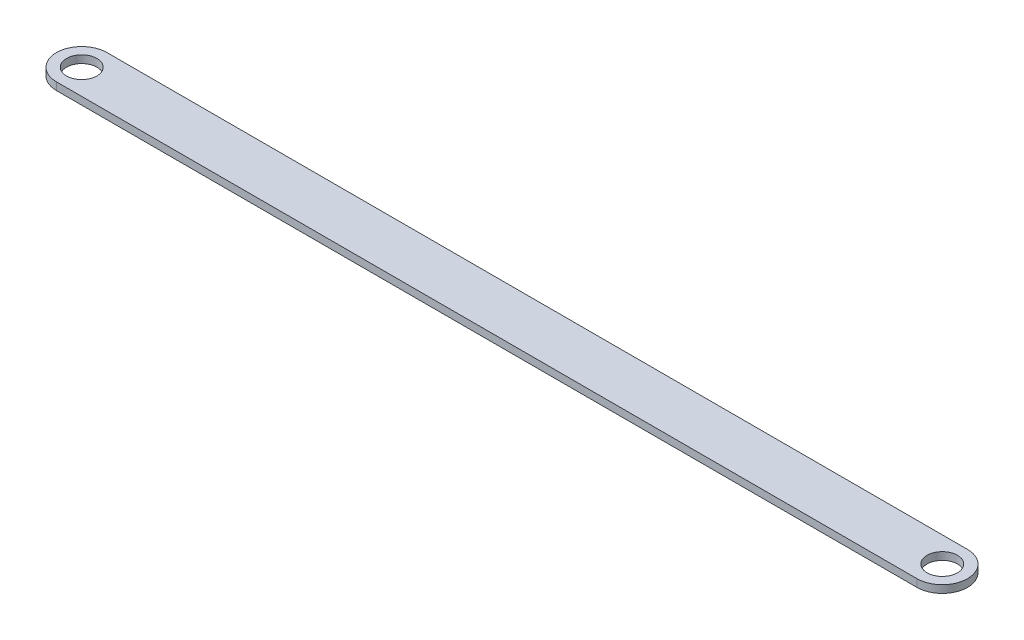
ISO-10303-21;
HEADER;
FILE_DESCRIPTION(('STEP AP214'),'2;1');
FILE_NAME('part.step','',(''),(''),'','','');
FILE_SCHEMA(('AUTOMOTIVE_DESIGN { 1 0 10303 214 1 1 1 1 }'));
ENDSEC;
DATA;
#1=APPLICATION_CONTEXT('core data for automotive mechanical design processes');
#2=APPLICATION_PROTOCOL_DEFINITION('international standard','automotive_design',2000,#1);
#3=PRODUCT_CONTEXT('',#1,'mechanical');
#4=PRODUCT('Part','Part','',(#3));
#5=PRODUCT_RELATED_PRODUCT_CATEGORY('part','',(#4));
#6=PRODUCT_DEFINITION_FORMATION('','',#4);
#7=PRODUCT_DEFINITION_CONTEXT('part definition',#1,'design');
#8=PRODUCT_DEFINITION('design','',#6,#7);
#9=PRODUCT_DEFINITION_SHAPE('','',#8);
#10=(LENGTH_UNIT() NAMED_UNIT(*) SI_UNIT(.MILLI.,.METRE.));
#11=(NAMED_UNIT(*) PLANE_ANGLE_UNIT() SI_UNIT($,.RADIAN.));
#12=(NAMED_UNIT(*) SI_UNIT($,.STERADIAN.) SOLID_ANGLE_UNIT());
#13=UNCERTAINTY_MEASURE_WITH_UNIT(LENGTH_MEASURE(1.E-05),#10,'distance_accuracy_value','');
#14=(GEOMETRIC_REPRESENTATION_CONTEXT(3) GLOBAL_UNCERTAINTY_ASSIGNED_CONTEXT((#13)) GLOBAL_UNIT_ASSIGNED_CONTEXT((#10,
#11,#12)) REPRESENTATION_CONTEXT('',''));
#15=CARTESIAN_POINT('',(0.,0.,0.));
#16=DIRECTION('',(0.,0.,1.));
#17=DIRECTION('',(1.,0.,0.));
#18=AXIS2_PLACEMENT_3D('',#15,#16,#17);
#19=CARTESIAN_POINT('',(-62.687563754482,3.,-5.85714285714286));
#20=DIRECTION('',(0.,1.,0.));
#21=DIRECTION('',(0.,0.,1.));
#22=AXIS2_PLACEMENT_3D('',#19,#20,#21);
#23=PLANE('',#22);
#24=CARTESIAN_POINT('',(-62.687563754482,3.,-5.85714285714286));
#25=DIRECTION('',(0.,1.,0.));
#26=DIRECTION('',(0.,0.,1.));
#27=AXIS2_PLACEMENT_3D('',#24,#25,#26);
#28=CIRCLE('',#27,6.);
#29=CARTESIAN_POINT('',(-62.687563754482,3.,0.142857142857137));
#30=VERTEX_POINT('',#29);
#31=EDGE_CURVE('E112',#30,#30,#28,.T.);
#32=ORIENTED_EDGE('',*,*,#31,.F.);
#33=EDGE_LOOP('',(#32));
#34=FACE_BOUND('',#33,.T.);
#35=CARTESIAN_POINT('',(-62.687563754482,3.,-5.85714285714286));
#36=DIRECTION('',(0.,1.,0.));
#37=DIRECTION('',(0.,0.,1.));
#38=AXIS2_PLACEMENT_3D('',#35,#36,#37);
#39=CIRCLE('',#38,10.);
#40=CARTESIAN_POINT('',(-62.687563754482,3.,-15.8571428571429));
#41=VERTEX_POINT('',#40);
#42=CARTESIAN_POINT('',(-62.687563754482,3.,4.14285714285714));
#43=VERTEX_POINT('',#42);
#44=EDGE_CURVE('E92',#41,#43,#39,.T.);
#45=ORIENTED_EDGE('',*,*,#44,.T.);
#46=DIRECTION('',(1.,0.,0.));
#47=VECTOR('',#46,1.);
#48=CARTESIAN_POINT('',(-62.687563754482,3.,4.14285714285714));
#49=LINE('',#48,#47);
#50=CARTESIAN_POINT('',(277.312436245518,3.,4.14285714285713));
#51=VERTEX_POINT('',#50);
#52=EDGE_CURVE('E87',#43,#51,#49,.T.);
#53=ORIENTED_EDGE('',*,*,#52,.T.);
#54=CARTESIAN_POINT('',(277.312436245518,3.,-5.85714285714286));
#55=DIRECTION('',(0.,1.,0.));
#56=DIRECTION('',(0.,0.,1.));
#57=AXIS2_PLACEMENT_3D('',#54,#55,#56);
#58=CIRCLE('',#57,10.);
#59=CARTESIAN_POINT('',(277.312436245518,3.,-15.8571428571429));
#60=VERTEX_POINT('',#59);
#61=EDGE_CURVE('E90',#51,#60,#58,.T.);
#62=ORIENTED_EDGE('',*,*,#61,.T.);
#63=DIRECTION('',(-1.,0.,0.));
#64=VECTOR('',#63,1.);
#65=CARTESIAN_POINT('',(-62.687563754482,3.,-15.8571428571429));
#66=LINE('',#65,#64);
#67=EDGE_CURVE('E57',#60,#41,#66,.T.);
#68=ORIENTED_EDGE('',*,*,#67,.T.);
#69=EDGE_LOOP('',(#45,#53,#62,#68));
#70=FACE_BOUND('',#69,.T.);
#71=CARTESIAN_POINT('',(277.312436245518,3.,-5.85714285714286));
#72=DIRECTION('',(0.,1.,0.));
#73=DIRECTION('',(0.,0.,1.));
#74=AXIS2_PLACEMENT_3D('',#71,#72,#73);
#75=CIRCLE('',#74,5.99999999999999);
#76=CARTESIAN_POINT('',(277.312436245518,3.,0.142857142857124));
#77=VERTEX_POINT('',#76);
#78=EDGE_CURVE('E134',#77,#77,#75,.T.);
#79=ORIENTED_EDGE('',*,*,#78,.F.);
#80=EDGE_LOOP('',(#79));
#81=FACE_BOUND('',#80,.T.);
#82=ADVANCED_FACE('F39',(#34,#70,#81),#23,.T.);
#83=CARTESIAN_POINT('',(-62.687563754482,0.,-5.85714285714286));
#84=DIRECTION('',(0.,1.,0.));
#85=DIRECTION('',(0.,0.,1.));
#86=AXIS2_PLACEMENT_3D('',#83,#84,#85);
#87=PLANE('',#86);
#88=CARTESIAN_POINT('',(-62.687563754482,0.,-5.85714285714286));
#89=DIRECTION('',(0.,1.,0.));
#90=DIRECTION('',(0.,0.,1.));
#91=AXIS2_PLACEMENT_3D('',#88,#89,#90);
#92=CIRCLE('',#91,10.);
#93=CARTESIAN_POINT('',(-62.687563754482,0.,-15.8571428571429));
#94=VERTEX_POINT('',#93);
#95=CARTESIAN_POINT('',(-62.687563754482,0.,4.14285714285714));
#96=VERTEX_POINT('',#95);
#97=EDGE_CURVE('E108',#94,#96,#92,.T.);
#98=ORIENTED_EDGE('',*,*,#97,.F.);
#99=DIRECTION('',(-1.,0.,0.));
#100=VECTOR('',#99,1.);
#101=CARTESIAN_POINT('',(-62.687563754482,0.,-15.8571428571429));
#102=LINE('',#101,#100);
#103=CARTESIAN_POINT('',(277.312436245518,0.,-15.8571428571429));
#104=VERTEX_POINT('',#103);
#105=EDGE_CURVE('E80',#104,#94,#102,.T.);
#106=ORIENTED_EDGE('',*,*,#105,.F.);
#107=CARTESIAN_POINT('',(277.312436245518,0.,-5.85714285714286));
#108=DIRECTION('',(0.,1.,0.));
#109=DIRECTION('',(0.,0.,1.));
#110=AXIS2_PLACEMENT_3D('',#107,#108,#109);
#111=CIRCLE('',#110,10.);
#112=CARTESIAN_POINT('',(277.312436245518,0.,4.14285714285713));
#113=VERTEX_POINT('',#112);
#114=EDGE_CURVE('E74',#113,#104,#111,.T.);
#115=ORIENTED_EDGE('',*,*,#114,.F.);
#116=DIRECTION('',(1.,0.,0.));
#117=VECTOR('',#116,1.);
#118=CARTESIAN_POINT('',(-62.687563754482,0.,4.14285714285714));
#119=LINE('',#118,#117);
#120=EDGE_CURVE('E97',#96,#113,#119,.T.);
#121=ORIENTED_EDGE('',*,*,#120,.F.);
#122=EDGE_LOOP('',(#98,#106,#115,#121));
#123=FACE_BOUND('',#122,.T.);
#124=CARTESIAN_POINT('',(-62.687563754482,0.,-5.85714285714286));
#125=DIRECTION('',(0.,1.,0.));
#126=DIRECTION('',(0.,0.,1.));
#127=AXIS2_PLACEMENT_3D('',#124,#125,#126);
#128=CIRCLE('',#127,6.);
#129=CARTESIAN_POINT('',(-62.687563754482,0.,0.142857142857137));
#130=VERTEX_POINT('',#129);
#131=EDGE_CURVE('E130',#130,#130,#128,.T.);
#132=ORIENTED_EDGE('',*,*,#131,.T.);
#133=EDGE_LOOP('',(#132));
#134=FACE_BOUND('',#133,.T.);
#135=CARTESIAN_POINT('',(277.312436245518,0.,-5.85714285714286));
#136=DIRECTION('',(0.,1.,0.));
#137=DIRECTION('',(0.,0.,1.));
#138=AXIS2_PLACEMENT_3D('',#135,#136,#137);
#139=CIRCLE('',#138,5.99999999999999);
#140=CARTESIAN_POINT('',(277.312436245518,0.,0.142857142857124));
#141=VERTEX_POINT('',#140);
#142=EDGE_CURVE('E138',#141,#141,#139,.T.);
#143=ORIENTED_EDGE('',*,*,#142,.T.);
#144=EDGE_LOOP('',(#143));
#145=FACE_BOUND('',#144,.T.);
#146=ADVANCED_FACE('F125',(#123,#134,#145),#87,.F.);
#147=CARTESIAN_POINT('',(-62.687563754482,3.,-5.85714285714286));
#148=DIRECTION('',(0.,-1.,0.));
#149=DIRECTION('',(0.,0.,-1.));
#150=AXIS2_PLACEMENT_3D('',#147,#148,#149);
#151=CYLINDRICAL_SURFACE('',#150,10.);
#152=ORIENTED_EDGE('',*,*,#97,.T.);
#153=DIRECTION('',(0.,-1.,0.));
#154=VECTOR('',#153,1.);
#155=CARTESIAN_POINT('',(-62.687563754482,3.,4.14285714285714));
#156=LINE('',#155,#154);
#157=EDGE_CURVE('E11',#43,#96,#156,.T.);
#158=ORIENTED_EDGE('',*,*,#157,.F.);
#159=ORIENTED_EDGE('',*,*,#44,.F.);
#160=DIRECTION('',(0.,-1.,0.));
#161=VECTOR('',#160,1.);
#162=CARTESIAN_POINT('',(-62.687563754482,3.,-15.8571428571429));
#163=LINE('',#162,#161);
#164=EDGE_CURVE('E104',#41,#94,#163,.T.);
#165=ORIENTED_EDGE('',*,*,#164,.T.);
#166=EDGE_LOOP('',(#152,#158,#159,#165));
#167=FACE_BOUND('',#166,.T.);
#168=ADVANCED_FACE('F41',(#167),#151,.T.);
#169=CARTESIAN_POINT('',(-62.687563754482,3.,4.14285714285714));
#170=DIRECTION('',(0.,0.,-1.));
#171=DIRECTION('',(-1.,0.,0.));
#172=AXIS2_PLACEMENT_3D('',#169,#170,#171);
#173=PLANE('',#172);
#174=ORIENTED_EDGE('',*,*,#120,.T.);
#175=DIRECTION('',(0.,-1.,0.));
#176=VECTOR('',#175,1.);
#177=CARTESIAN_POINT('',(277.312436245518,3.,4.14285714285713));
#178=LINE('',#177,#176);
#179=EDGE_CURVE('E49',#51,#113,#178,.T.);
#180=ORIENTED_EDGE('',*,*,#179,.F.);
#181=ORIENTED_EDGE('',*,*,#52,.F.);
#182=ORIENTED_EDGE('',*,*,#157,.T.);
#183=EDGE_LOOP('',(#174,#180,#181,#182));
#184=FACE_BOUND('',#183,.T.);
#185=ADVANCED_FACE('F96',(#184),#173,.F.);
#186=CARTESIAN_POINT('',(277.312436245518,3.,-5.85714285714286));
#187=DIRECTION('',(0.,-1.,0.));
#188=DIRECTION('',(0.,0.,-1.));
#189=AXIS2_PLACEMENT_3D('',#186,#187,#188);
#190=CYLINDRICAL_SURFACE('',#189,10.);
#191=ORIENTED_EDGE('',*,*,#114,.T.);
#192=DIRECTION('',(0.,-1.,0.));
#193=VECTOR('',#192,1.);
#194=CARTESIAN_POINT('',(277.312436245518,3.,-15.8571428571429));
#195=LINE('',#194,#193);
#196=EDGE_CURVE('E99',#60,#104,#195,.T.);
#197=ORIENTED_EDGE('',*,*,#196,.F.);
#198=ORIENTED_EDGE('',*,*,#61,.F.);
#199=ORIENTED_EDGE('',*,*,#179,.T.);
#200=EDGE_LOOP('',(#191,#197,#198,#199));
#201=FACE_BOUND('',#200,.T.);
#202=ADVANCED_FACE('F100',(#201),#190,.T.);
#203=CARTESIAN_POINT('',(-62.687563754482,3.,-15.8571428571429));
#204=DIRECTION('',(0.,0.,1.));
#205=DIRECTION('',(1.,0.,0.));
#206=AXIS2_PLACEMENT_3D('',#203,#204,#205);
#207=PLANE('',#206);
#208=ORIENTED_EDGE('',*,*,#105,.T.);
#209=ORIENTED_EDGE('',*,*,#164,.F.);
#210=ORIENTED_EDGE('',*,*,#67,.F.);
#211=ORIENTED_EDGE('',*,*,#196,.T.);
#212=EDGE_LOOP('',(#208,#209,#210,#211));
#213=FACE_BOUND('',#212,.T.);
#214=ADVANCED_FACE('F122',(#213),#207,.F.);
#215=CARTESIAN_POINT('',(-62.687563754482,3.,-5.85714285714286));
#216=DIRECTION('',(0.,-1.,0.));
#217=DIRECTION('',(0.,0.,-1.));
#218=AXIS2_PLACEMENT_3D('',#215,#216,#217);
#219=CYLINDRICAL_SURFACE('',#218,6.);
#220=ORIENTED_EDGE('',*,*,#31,.T.);
#221=EDGE_LOOP('',(#220));
#222=FACE_BOUND('',#221,.T.);
#223=ORIENTED_EDGE('',*,*,#131,.F.);
#224=EDGE_LOOP('',(#223));
#225=FACE_BOUND('',#224,.T.);
#226=ADVANCED_FACE('F157',(#222,#225),#219,.F.);
#227=CARTESIAN_POINT('',(277.312436245518,3.,-5.85714285714286));
#228=DIRECTION('',(0.,-1.,0.));
#229=DIRECTION('',(0.,0.,-1.));
#230=AXIS2_PLACEMENT_3D('',#227,#228,#229);
#231=CYLINDRICAL_SURFACE('',#230,5.99999999999999);
#232=ORIENTED_EDGE('',*,*,#78,.T.);
#233=EDGE_LOOP('',(#232));
#234=FACE_BOUND('',#233,.T.);
#235=ORIENTED_EDGE('',*,*,#142,.F.);
#236=EDGE_LOOP('',(#235));
#237=FACE_BOUND('',#236,.T.);
#238=ADVANCED_FACE('F146',(#234,#237),#231,.F.);
#239=CLOSED_SHELL('',(#82,#146,#168,#185,#202,#214,#226,#238));
#240=MANIFOLD_SOLID_BREP('B2',#239);
#241=ADVANCED_BREP_SHAPE_REPRESENTATION('',(#18,#240),#14);
#242=SHAPE_DEFINITION_REPRESENTATION(#9,#241);
ENDSEC;
END-ISO-10303-21;
